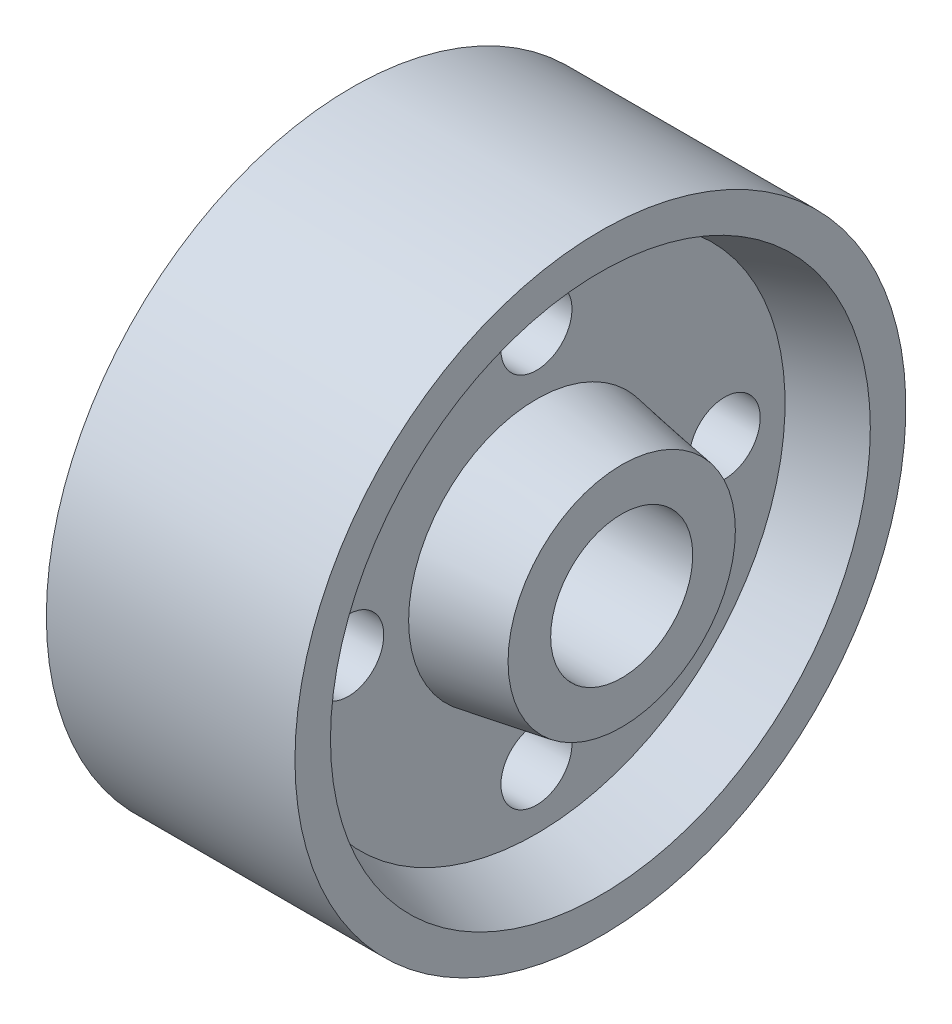
ISO-10303-21;
HEADER;
FILE_DESCRIPTION(('STEP AP214'),'2;1');
FILE_NAME('part.step','',(''),(''),'','','');
FILE_SCHEMA(('AUTOMOTIVE_DESIGN { 1 0 10303 214 1 1 1 1 }'));
ENDSEC;
DATA;
#1=APPLICATION_CONTEXT('core data for automotive mechanical design processes');
#2=APPLICATION_PROTOCOL_DEFINITION('international standard','automotive_design',2000,#1);
#3=PRODUCT_CONTEXT('',#1,'mechanical');
#4=PRODUCT('Part','Part','',(#3));
#5=PRODUCT_RELATED_PRODUCT_CATEGORY('part','',(#4));
#6=PRODUCT_DEFINITION_FORMATION('','',#4);
#7=PRODUCT_DEFINITION_CONTEXT('part definition',#1,'design');
#8=PRODUCT_DEFINITION('design','',#6,#7);
#9=PRODUCT_DEFINITION_SHAPE('','',#8);
#10=(LENGTH_UNIT() NAMED_UNIT(*) SI_UNIT(.MILLI.,.METRE.));
#11=(NAMED_UNIT(*) PLANE_ANGLE_UNIT() SI_UNIT($,.RADIAN.));
#12=(NAMED_UNIT(*) SI_UNIT($,.STERADIAN.) SOLID_ANGLE_UNIT());
#13=UNCERTAINTY_MEASURE_WITH_UNIT(LENGTH_MEASURE(1.E-05),#10,'distance_accuracy_value','');
#14=(GEOMETRIC_REPRESENTATION_CONTEXT(3) GLOBAL_UNCERTAINTY_ASSIGNED_CONTEXT((#13)) GLOBAL_UNIT_ASSIGNED_CONTEXT((#10,
#11,#12)) REPRESENTATION_CONTEXT('',''));
#15=CARTESIAN_POINT('',(0.,0.,0.));
#16=DIRECTION('',(0.,0.,1.));
#17=DIRECTION('',(1.,0.,0.));
#18=AXIS2_PLACEMENT_3D('',#15,#16,#17);
#19=CARTESIAN_POINT('',(41.,0.,0.));
#20=DIRECTION('',(-1.,0.,0.));
#21=DIRECTION('',(0.,0.,1.));
#22=AXIS2_PLACEMENT_3D('',#19,#20,#21);
#23=PLANE('',#22);
#24=CARTESIAN_POINT('',(41.,0.,0.));
#25=DIRECTION('',(-1.,0.,0.));
#26=DIRECTION('',(0.,0.,1.));
#27=AXIS2_PLACEMENT_3D('',#24,#25,#26);
#28=CIRCLE('',#27,10.);
#29=CARTESIAN_POINT('',(41.,0.,10.));
#30=VERTEX_POINT('',#29);
#31=EDGE_CURVE('E55',#30,#30,#28,.T.);
#32=ORIENTED_EDGE('',*,*,#31,.T.);
#33=EDGE_LOOP('',(#32));
#34=FACE_BOUND('',#33,.T.);
#35=CARTESIAN_POINT('',(41.,0.,0.));
#36=DIRECTION('',(-1.,0.,0.));
#37=DIRECTION('',(0.,0.,1.));
#38=AXIS2_PLACEMENT_3D('',#35,#36,#37);
#39=CIRCLE('',#38,16.);
#40=CARTESIAN_POINT('',(41.,0.,16.));
#41=VERTEX_POINT('',#40);
#42=EDGE_CURVE('E10',#41,#41,#39,.T.);
#43=ORIENTED_EDGE('',*,*,#42,.F.);
#44=EDGE_LOOP('',(#43));
#45=FACE_BOUND('',#44,.T.);
#46=ADVANCED_FACE('F35',(#34,#45),#23,.F.);
#47=CARTESIAN_POINT('',(41.,0.,0.));
#48=DIRECTION('',(-1.,0.,0.));
#49=DIRECTION('',(0.,0.,1.));
#50=AXIS2_PLACEMENT_3D('',#47,#48,#49);
#51=CONICAL_SURFACE('',#50,16.,0.165148677414626);
#52=CARTESIAN_POINT('',(29.,0.,0.));
#53=DIRECTION('',(-1.,0.,0.));
#54=DIRECTION('',(0.,0.,1.));
#55=AXIS2_PLACEMENT_3D('',#52,#53,#54);
#56=CIRCLE('',#55,18.);
#57=CARTESIAN_POINT('',(29.,0.,18.));
#58=VERTEX_POINT('',#57);
#59=EDGE_CURVE('E42',#58,#58,#56,.T.);
#60=ORIENTED_EDGE('',*,*,#59,.F.);
#61=EDGE_LOOP('',(#60));
#62=FACE_BOUND('',#61,.T.);
#63=ORIENTED_EDGE('',*,*,#42,.T.);
#64=EDGE_LOOP('',(#63));
#65=FACE_BOUND('',#64,.T.);
#66=ADVANCED_FACE('F104',(#62,#65),#51,.T.);
#67=CARTESIAN_POINT('',(29.,18.,0.));
#68=DIRECTION('',(-1.,0.,0.));
#69=DIRECTION('',(0.,0.,1.));
#70=AXIS2_PLACEMENT_3D('',#67,#68,#69);
#71=PLANE('',#70);
#72=CARTESIAN_POINT('',(29.,26.5,0.));
#73=DIRECTION('',(-1.,0.,0.));
#74=DIRECTION('',(0.,0.,1.));
#75=AXIS2_PLACEMENT_3D('',#72,#73,#74);
#76=CIRCLE('',#75,5.);
#77=CARTESIAN_POINT('',(29.,26.5,5.));
#78=VERTEX_POINT('',#77);
#79=EDGE_CURVE('E73',#78,#78,#76,.T.);
#80=ORIENTED_EDGE('',*,*,#79,.T.);
#81=EDGE_LOOP('',(#80));
#82=FACE_BOUND('',#81,.T.);
#83=CARTESIAN_POINT('',(29.,0.,26.5));
#84=DIRECTION('',(-1.,0.,0.));
#85=DIRECTION('',(0.,0.,1.));
#86=AXIS2_PLACEMENT_3D('',#83,#84,#85);
#87=CIRCLE('',#86,5.);
#88=CARTESIAN_POINT('',(29.,0.,31.5));
#89=VERTEX_POINT('',#88);
#90=EDGE_CURVE('E61',#89,#89,#87,.T.);
#91=ORIENTED_EDGE('',*,*,#90,.T.);
#92=EDGE_LOOP('',(#91));
#93=FACE_BOUND('',#92,.T.);
#94=CARTESIAN_POINT('',(29.,-26.5,0.));
#95=DIRECTION('',(-1.,0.,0.));
#96=DIRECTION('',(0.,0.,1.));
#97=AXIS2_PLACEMENT_3D('',#94,#95,#96);
#98=CIRCLE('',#97,5.);
#99=CARTESIAN_POINT('',(29.,-26.5,5.00000000000001));
#100=VERTEX_POINT('',#99);
#101=EDGE_CURVE('E58',#100,#100,#98,.T.);
#102=ORIENTED_EDGE('',*,*,#101,.T.);
#103=EDGE_LOOP('',(#102));
#104=FACE_BOUND('',#103,.T.);
#105=CARTESIAN_POINT('',(29.,0.,-26.5));
#106=DIRECTION('',(-1.,0.,0.));
#107=DIRECTION('',(0.,0.,1.));
#108=AXIS2_PLACEMENT_3D('',#105,#106,#107);
#109=CIRCLE('',#108,5.);
#110=CARTESIAN_POINT('',(29.,0.,-21.5));
#111=VERTEX_POINT('',#110);
#112=EDGE_CURVE('E54',#111,#111,#109,.T.);
#113=ORIENTED_EDGE('',*,*,#112,.T.);
#114=EDGE_LOOP('',(#113));
#115=FACE_BOUND('',#114,.T.);
#116=CARTESIAN_POINT('',(29.,0.,0.));
#117=DIRECTION('',(-1.,0.,0.));
#118=DIRECTION('',(0.,0.,1.));
#119=AXIS2_PLACEMENT_3D('',#116,#117,#118);
#120=CIRCLE('',#119,35.);
#121=CARTESIAN_POINT('',(29.,0.,35.));
#122=VERTEX_POINT('',#121);
#123=EDGE_CURVE('E47',#122,#122,#120,.T.);
#124=ORIENTED_EDGE('',*,*,#123,.F.);
#125=EDGE_LOOP('',(#124));
#126=FACE_BOUND('',#125,.T.);
#127=ORIENTED_EDGE('',*,*,#59,.T.);
#128=EDGE_LOOP('',(#127));
#129=FACE_BOUND('',#128,.T.);
#130=ADVANCED_FACE('F101',(#82,#93,#104,#115,#126,#129),#71,.F.);
#131=CARTESIAN_POINT('',(29.,0.,0.));
#132=DIRECTION('',(1.,0.,0.));
#133=DIRECTION('',(0.,0.,-1.));
#134=AXIS2_PLACEMENT_3D('',#131,#132,#133);
#135=CONICAL_SURFACE('',#134,35.,0.321750554396643);
#136=CARTESIAN_POINT('',(38.,0.,0.));
#137=DIRECTION('',(-1.,0.,0.));
#138=DIRECTION('',(0.,0.,1.));
#139=AXIS2_PLACEMENT_3D('',#136,#137,#138);
#140=CIRCLE('',#139,38.);
#141=CARTESIAN_POINT('',(38.,0.,38.));
#142=VERTEX_POINT('',#141);
#143=EDGE_CURVE('E94',#142,#142,#140,.T.);
#144=ORIENTED_EDGE('',*,*,#143,.F.);
#145=EDGE_LOOP('',(#144));
#146=FACE_BOUND('',#145,.T.);
#147=ORIENTED_EDGE('',*,*,#123,.T.);
#148=EDGE_LOOP('',(#147));
#149=FACE_BOUND('',#148,.T.);
#150=ADVANCED_FACE('F99',(#146,#149),#135,.F.);
#151=CARTESIAN_POINT('',(38.,38.,0.));
#152=DIRECTION('',(-1.,0.,0.));
#153=DIRECTION('',(0.,0.,1.));
#154=AXIS2_PLACEMENT_3D('',#151,#152,#153);
#155=PLANE('',#154);
#156=CARTESIAN_POINT('',(38.,0.,0.));
#157=DIRECTION('',(-1.,0.,0.));
#158=DIRECTION('',(0.,0.,1.));
#159=AXIS2_PLACEMENT_3D('',#156,#157,#158);
#160=CIRCLE('',#159,43.);
#161=CARTESIAN_POINT('',(38.,0.,43.));
#162=VERTEX_POINT('',#161);
#163=EDGE_CURVE('E91',#162,#162,#160,.T.);
#164=ORIENTED_EDGE('',*,*,#163,.F.);
#165=EDGE_LOOP('',(#164));
#166=FACE_BOUND('',#165,.T.);
#167=ORIENTED_EDGE('',*,*,#143,.T.);
#168=EDGE_LOOP('',(#167));
#169=FACE_BOUND('',#168,.T.);
#170=ADVANCED_FACE('F117',(#166,#169),#155,.F.);
#171=CARTESIAN_POINT('',(0.,0.,0.));
#172=DIRECTION('',(-1.,0.,0.));
#173=DIRECTION('',(0.,0.,1.));
#174=AXIS2_PLACEMENT_3D('',#171,#172,#173);
#175=CYLINDRICAL_SURFACE('',#174,43.);
#176=CARTESIAN_POINT('',(3.,0.,0.));
#177=DIRECTION('',(-1.,0.,0.));
#178=DIRECTION('',(0.,0.,1.));
#179=AXIS2_PLACEMENT_3D('',#176,#177,#178);
#180=CIRCLE('',#179,43.);
#181=CARTESIAN_POINT('',(3.,0.,43.));
#182=VERTEX_POINT('',#181);
#183=EDGE_CURVE('E88',#182,#182,#180,.T.);
#184=ORIENTED_EDGE('',*,*,#183,.F.);
#185=EDGE_LOOP('',(#184));
#186=FACE_BOUND('',#185,.T.);
#187=ORIENTED_EDGE('',*,*,#163,.T.);
#188=EDGE_LOOP('',(#187));
#189=FACE_BOUND('',#188,.T.);
#190=ADVANCED_FACE('F121',(#186,#189),#175,.T.);
#191=CARTESIAN_POINT('',(3.,38.,0.));
#192=DIRECTION('',(1.,0.,0.));
#193=DIRECTION('',(0.,0.,-1.));
#194=AXIS2_PLACEMENT_3D('',#191,#192,#193);
#195=PLANE('',#194);
#196=CARTESIAN_POINT('',(3.,0.,0.));
#197=DIRECTION('',(-1.,0.,0.));
#198=DIRECTION('',(0.,0.,1.));
#199=AXIS2_PLACEMENT_3D('',#196,#197,#198);
#200=CIRCLE('',#199,38.);
#201=CARTESIAN_POINT('',(3.,0.,38.));
#202=VERTEX_POINT('',#201);
#203=EDGE_CURVE('E85',#202,#202,#200,.T.);
#204=ORIENTED_EDGE('',*,*,#203,.F.);
#205=EDGE_LOOP('',(#204));
#206=FACE_BOUND('',#205,.T.);
#207=ORIENTED_EDGE('',*,*,#183,.T.);
#208=EDGE_LOOP('',(#207));
#209=FACE_BOUND('',#208,.T.);
#210=ADVANCED_FACE('F125',(#206,#209),#195,.F.);
#211=CARTESIAN_POINT('',(3.,0.,0.));
#212=DIRECTION('',(-1.,0.,0.));
#213=DIRECTION('',(0.,0.,1.));
#214=AXIS2_PLACEMENT_3D('',#211,#212,#213);
#215=CONICAL_SURFACE('',#214,38.,0.321750554396642);
#216=CARTESIAN_POINT('',(12.,0.,0.));
#217=DIRECTION('',(-1.,0.,0.));
#218=DIRECTION('',(0.,0.,1.));
#219=AXIS2_PLACEMENT_3D('',#216,#217,#218);
#220=CIRCLE('',#219,35.);
#221=CARTESIAN_POINT('',(12.,0.,35.));
#222=VERTEX_POINT('',#221);
#223=EDGE_CURVE('E82',#222,#222,#220,.T.);
#224=ORIENTED_EDGE('',*,*,#223,.F.);
#225=EDGE_LOOP('',(#224));
#226=FACE_BOUND('',#225,.T.);
#227=ORIENTED_EDGE('',*,*,#203,.T.);
#228=EDGE_LOOP('',(#227));
#229=FACE_BOUND('',#228,.T.);
#230=ADVANCED_FACE('F129',(#226,#229),#215,.F.);
#231=CARTESIAN_POINT('',(12.,18.,0.));
#232=DIRECTION('',(1.,0.,0.));
#233=DIRECTION('',(0.,0.,-1.));
#234=AXIS2_PLACEMENT_3D('',#231,#232,#233);
#235=PLANE('',#234);
#236=CARTESIAN_POINT('',(12.,26.5,0.));
#237=DIRECTION('',(1.,0.,0.));
#238=DIRECTION('',(0.,0.,-1.));
#239=AXIS2_PLACEMENT_3D('',#236,#237,#238);
#240=CIRCLE('',#239,5.);
#241=CARTESIAN_POINT('',(12.,26.5,-5.));
#242=VERTEX_POINT('',#241);
#243=EDGE_CURVE('E38',#242,#242,#240,.T.);
#244=ORIENTED_EDGE('',*,*,#243,.T.);
#245=EDGE_LOOP('',(#244));
#246=FACE_BOUND('',#245,.T.);
#247=CARTESIAN_POINT('',(12.,0.,26.5));
#248=DIRECTION('',(1.,0.,0.));
#249=DIRECTION('',(0.,0.,-1.));
#250=AXIS2_PLACEMENT_3D('',#247,#248,#249);
#251=CIRCLE('',#250,5.);
#252=CARTESIAN_POINT('',(12.,0.,21.5));
#253=VERTEX_POINT('',#252);
#254=EDGE_CURVE('E59',#253,#253,#251,.T.);
#255=ORIENTED_EDGE('',*,*,#254,.T.);
#256=EDGE_LOOP('',(#255));
#257=FACE_BOUND('',#256,.T.);
#258=CARTESIAN_POINT('',(12.,-26.5,0.));
#259=DIRECTION('',(1.,0.,0.));
#260=DIRECTION('',(0.,0.,-1.));
#261=AXIS2_PLACEMENT_3D('',#258,#259,#260);
#262=CIRCLE('',#261,5.);
#263=CARTESIAN_POINT('',(12.,-26.5,-5.));
#264=VERTEX_POINT('',#263);
#265=EDGE_CURVE('E56',#264,#264,#262,.T.);
#266=ORIENTED_EDGE('',*,*,#265,.T.);
#267=EDGE_LOOP('',(#266));
#268=FACE_BOUND('',#267,.T.);
#269=CARTESIAN_POINT('',(12.,0.,-26.5));
#270=DIRECTION('',(1.,0.,0.));
#271=DIRECTION('',(0.,0.,-1.));
#272=AXIS2_PLACEMENT_3D('',#269,#270,#271);
#273=CIRCLE('',#272,5.);
#274=CARTESIAN_POINT('',(12.,0.,-31.5));
#275=VERTEX_POINT('',#274);
#276=EDGE_CURVE('E51',#275,#275,#273,.T.);
#277=ORIENTED_EDGE('',*,*,#276,.T.);
#278=EDGE_LOOP('',(#277));
#279=FACE_BOUND('',#278,.T.);
#280=CARTESIAN_POINT('',(12.,0.,0.));
#281=DIRECTION('',(-1.,0.,0.));
#282=DIRECTION('',(0.,0.,1.));
#283=AXIS2_PLACEMENT_3D('',#280,#281,#282);
#284=CIRCLE('',#283,18.);
#285=CARTESIAN_POINT('',(12.,0.,18.));
#286=VERTEX_POINT('',#285);
#287=EDGE_CURVE('E79',#286,#286,#284,.T.);
#288=ORIENTED_EDGE('',*,*,#287,.F.);
#289=EDGE_LOOP('',(#288));
#290=FACE_BOUND('',#289,.T.);
#291=ORIENTED_EDGE('',*,*,#223,.T.);
#292=EDGE_LOOP('',(#291));
#293=FACE_BOUND('',#292,.T.);
#294=ADVANCED_FACE('F133',(#246,#257,#268,#279,#290,#293),#235,.F.);
#295=CARTESIAN_POINT('',(12.,0.,0.));
#296=DIRECTION('',(1.,0.,0.));
#297=DIRECTION('',(0.,0.,-1.));
#298=AXIS2_PLACEMENT_3D('',#295,#296,#297);
#299=CONICAL_SURFACE('',#298,18.,0.165148677414627);
#300=CARTESIAN_POINT('',(0.,0.,0.));
#301=DIRECTION('',(-1.,0.,0.));
#302=DIRECTION('',(0.,0.,1.));
#303=AXIS2_PLACEMENT_3D('',#300,#301,#302);
#304=CIRCLE('',#303,16.);
#305=CARTESIAN_POINT('',(0.,0.,16.));
#306=VERTEX_POINT('',#305);
#307=EDGE_CURVE('E76',#306,#306,#304,.T.);
#308=ORIENTED_EDGE('',*,*,#307,.F.);
#309=EDGE_LOOP('',(#308));
#310=FACE_BOUND('',#309,.T.);
#311=ORIENTED_EDGE('',*,*,#287,.T.);
#312=EDGE_LOOP('',(#311));
#313=FACE_BOUND('',#312,.T.);
#314=ADVANCED_FACE('F137',(#310,#313),#299,.T.);
#315=CARTESIAN_POINT('',(0.,0.,0.));
#316=DIRECTION('',(1.,0.,0.));
#317=DIRECTION('',(0.,0.,-1.));
#318=AXIS2_PLACEMENT_3D('',#315,#316,#317);
#319=PLANE('',#318);
#320=CARTESIAN_POINT('',(0.,0.,0.));
#321=DIRECTION('',(-1.,0.,0.));
#322=DIRECTION('',(0.,0.,1.));
#323=AXIS2_PLACEMENT_3D('',#320,#321,#322);
#324=CIRCLE('',#323,10.);
#325=CARTESIAN_POINT('',(0.,0.,10.));
#326=VERTEX_POINT('',#325);
#327=EDGE_CURVE('E325',#326,#326,#324,.T.);
#328=ORIENTED_EDGE('',*,*,#327,.F.);
#329=EDGE_LOOP('',(#328));
#330=FACE_BOUND('',#329,.T.);
#331=ORIENTED_EDGE('',*,*,#307,.T.);
#332=EDGE_LOOP('',(#331));
#333=FACE_BOUND('',#332,.T.);
#334=ADVANCED_FACE('F141',(#330,#333),#319,.F.);
#335=CARTESIAN_POINT('',(41.,0.,0.));
#336=DIRECTION('',(-1.,0.,0.));
#337=DIRECTION('',(0.,0.,1.));
#338=AXIS2_PLACEMENT_3D('',#335,#336,#337);
#339=CYLINDRICAL_SURFACE('',#338,10.);
#340=ORIENTED_EDGE('',*,*,#31,.F.);
#341=EDGE_LOOP('',(#340));
#342=FACE_BOUND('',#341,.T.);
#343=ORIENTED_EDGE('',*,*,#327,.T.);
#344=EDGE_LOOP('',(#343));
#345=FACE_BOUND('',#344,.T.);
#346=ADVANCED_FACE('F145',(#342,#345),#339,.F.);
#347=CARTESIAN_POINT('',(41.,0.,-26.5));
#348=DIRECTION('',(-1.,0.,0.));
#349=DIRECTION('',(0.,0.,1.));
#350=AXIS2_PLACEMENT_3D('',#347,#348,#349);
#351=CYLINDRICAL_SURFACE('',#350,5.);
#352=ORIENTED_EDGE('',*,*,#276,.F.);
#353=EDGE_LOOP('',(#352));
#354=FACE_BOUND('',#353,.T.);
#355=ORIENTED_EDGE('',*,*,#112,.F.);
#356=EDGE_LOOP('',(#355));
#357=FACE_BOUND('',#356,.T.);
#358=ADVANCED_FACE('F149',(#354,#357),#351,.F.);
#359=CARTESIAN_POINT('',(41.,-26.5,0.));
#360=DIRECTION('',(-1.,0.,0.));
#361=DIRECTION('',(0.,0.,1.));
#362=AXIS2_PLACEMENT_3D('',#359,#360,#361);
#363=CYLINDRICAL_SURFACE('',#362,5.);
#364=ORIENTED_EDGE('',*,*,#265,.F.);
#365=EDGE_LOOP('',(#364));
#366=FACE_BOUND('',#365,.T.);
#367=ORIENTED_EDGE('',*,*,#101,.F.);
#368=EDGE_LOOP('',(#367));
#369=FACE_BOUND('',#368,.T.);
#370=ADVANCED_FACE('F155',(#366,#369),#363,.F.);
#371=CARTESIAN_POINT('',(41.,0.,26.5));
#372=DIRECTION('',(-1.,0.,0.));
#373=DIRECTION('',(0.,0.,1.));
#374=AXIS2_PLACEMENT_3D('',#371,#372,#373);
#375=CYLINDRICAL_SURFACE('',#374,5.);
#376=ORIENTED_EDGE('',*,*,#254,.F.);
#377=EDGE_LOOP('',(#376));
#378=FACE_BOUND('',#377,.T.);
#379=ORIENTED_EDGE('',*,*,#90,.F.);
#380=EDGE_LOOP('',(#379));
#381=FACE_BOUND('',#380,.T.);
#382=ADVANCED_FACE('F151',(#378,#381),#375,.F.);
#383=CARTESIAN_POINT('',(41.,26.5,0.));
#384=DIRECTION('',(-1.,0.,0.));
#385=DIRECTION('',(0.,0.,1.));
#386=AXIS2_PLACEMENT_3D('',#383,#384,#385);
#387=CYLINDRICAL_SURFACE('',#386,5.);
#388=ORIENTED_EDGE('',*,*,#243,.F.);
#389=EDGE_LOOP('',(#388));
#390=FACE_BOUND('',#389,.T.);
#391=ORIENTED_EDGE('',*,*,#79,.F.);
#392=EDGE_LOOP('',(#391));
#393=FACE_BOUND('',#392,.T.);
#394=ADVANCED_FACE('F154',(#390,#393),#387,.F.);
#395=CLOSED_SHELL('',(#46,#66,#130,#150,#170,#190,#210,#230,#294,#314,#334,#346,#358,#370,#382,#394));
#396=MANIFOLD_SOLID_BREP('B2',#395);
#397=ADVANCED_BREP_SHAPE_REPRESENTATION('',(#18,#396),#14);
#398=SHAPE_DEFINITION_REPRESENTATION(#9,#397);
ENDSEC;
END-ISO-10303-21;
